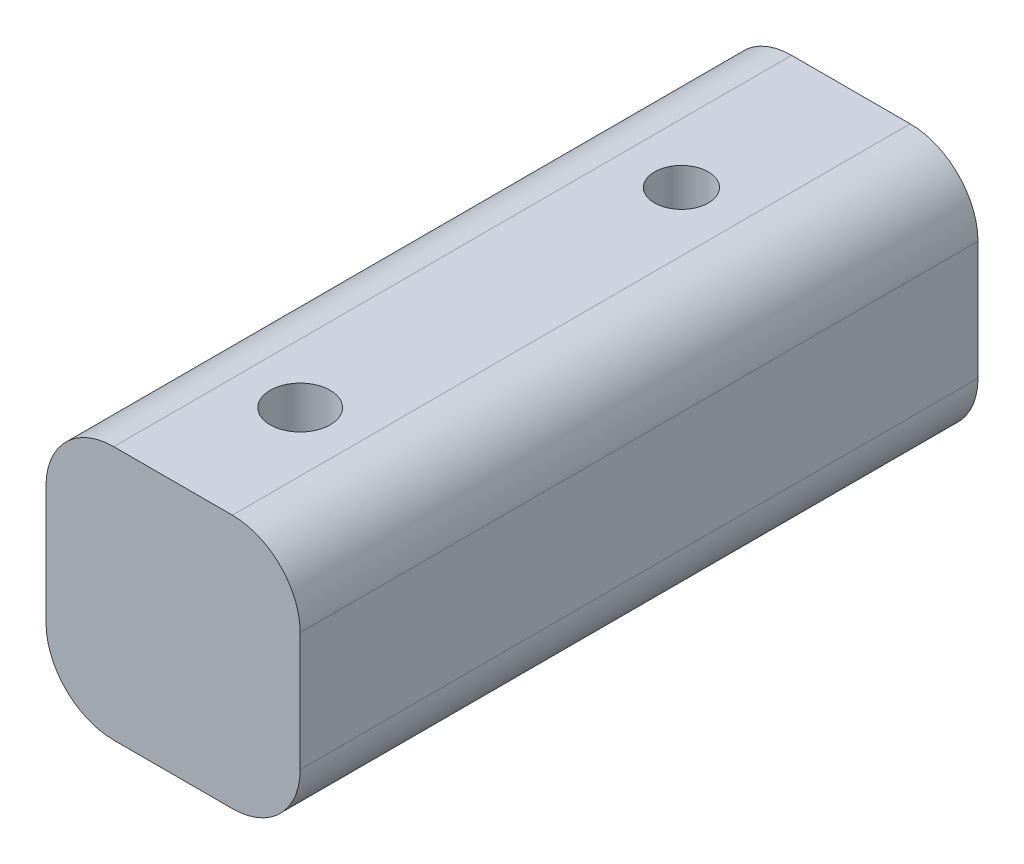
ISO-10303-21;
HEADER;
FILE_DESCRIPTION(('STEP AP214'),'2;1');
FILE_NAME('part.step','',(''),(''),'','','');
FILE_SCHEMA(('AUTOMOTIVE_DESIGN { 1 0 10303 214 1 1 1 1 }'));
ENDSEC;
DATA;
#1=APPLICATION_CONTEXT('core data for automotive mechanical design processes');
#2=APPLICATION_PROTOCOL_DEFINITION('international standard','automotive_design',2000,#1);
#3=PRODUCT_CONTEXT('',#1,'mechanical');
#4=PRODUCT('Part','Part','',(#3));
#5=PRODUCT_RELATED_PRODUCT_CATEGORY('part','',(#4));
#6=PRODUCT_DEFINITION_FORMATION('','',#4);
#7=PRODUCT_DEFINITION_CONTEXT('part definition',#1,'design');
#8=PRODUCT_DEFINITION('design','',#6,#7);
#9=PRODUCT_DEFINITION_SHAPE('','',#8);
#10=(LENGTH_UNIT() NAMED_UNIT(*) SI_UNIT(.MILLI.,.METRE.));
#11=(NAMED_UNIT(*) PLANE_ANGLE_UNIT() SI_UNIT($,.RADIAN.));
#12=(NAMED_UNIT(*) SI_UNIT($,.STERADIAN.) SOLID_ANGLE_UNIT());
#13=UNCERTAINTY_MEASURE_WITH_UNIT(LENGTH_MEASURE(1.E-05),#10,'distance_accuracy_value','');
#14=(GEOMETRIC_REPRESENTATION_CONTEXT(3) GLOBAL_UNCERTAINTY_ASSIGNED_CONTEXT((#13)) GLOBAL_UNIT_ASSIGNED_CONTEXT((#10,
#11,#12)) REPRESENTATION_CONTEXT('',''));
#15=CARTESIAN_POINT('',(0.,0.,0.));
#16=DIRECTION('',(0.,0.,1.));
#17=DIRECTION('',(1.,0.,0.));
#18=AXIS2_PLACEMENT_3D('',#15,#16,#17);
#19=CARTESIAN_POINT('',(9.525,9.525,50.8));
#20=DIRECTION('',(-1.,0.,0.));
#21=DIRECTION('',(0.,-1.,0.));
#22=AXIS2_PLACEMENT_3D('',#19,#20,#21);
#23=PLANE('',#22);
#24=DIRECTION('',(0.,1.,0.));
#25=VECTOR('',#24,1.);
#26=CARTESIAN_POINT('',(9.525,9.525,50.8));
#27=LINE('',#26,#25);
#28=CARTESIAN_POINT('',(9.525,-4.445,50.8));
#29=VERTEX_POINT('',#28);
#30=CARTESIAN_POINT('',(9.525,4.445,50.8));
#31=VERTEX_POINT('',#30);
#32=EDGE_CURVE('E237',#29,#31,#27,.T.);
#33=ORIENTED_EDGE('',*,*,#32,.F.);
#34=DIRECTION('',(0.,0.,-1.));
#35=VECTOR('',#34,1.);
#36=CARTESIAN_POINT('',(9.525,-4.445,50.8));
#37=LINE('',#36,#35);
#38=CARTESIAN_POINT('',(9.525,-4.445,0.));
#39=VERTEX_POINT('',#38);
#40=EDGE_CURVE('E339',#29,#39,#37,.T.);
#41=ORIENTED_EDGE('',*,*,#40,.T.);
#42=DIRECTION('',(0.,1.,0.));
#43=VECTOR('',#42,1.);
#44=CARTESIAN_POINT('',(9.525,9.525,0.));
#45=LINE('',#44,#43);
#46=CARTESIAN_POINT('',(9.525,4.445,0.));
#47=VERTEX_POINT('',#46);
#48=EDGE_CURVE('E220',#39,#47,#45,.T.);
#49=ORIENTED_EDGE('',*,*,#48,.T.);
#50=DIRECTION('',(0.,0.,-1.));
#51=VECTOR('',#50,1.);
#52=CARTESIAN_POINT('',(9.525,4.445,50.8));
#53=LINE('',#52,#51);
#54=EDGE_CURVE('E337',#47,#31,#53,.F.);
#55=ORIENTED_EDGE('',*,*,#54,.T.);
#56=EDGE_LOOP('',(#33,#41,#49,#55));
#57=FACE_BOUND('',#56,.T.);
#58=ADVANCED_FACE('F36',(#57),#23,.F.);
#59=CARTESIAN_POINT('',(-9.525,9.525,50.8));
#60=DIRECTION('',(0.,-1.,0.));
#61=DIRECTION('',(0.,0.,-1.));
#62=AXIS2_PLACEMENT_3D('',#59,#60,#61);
#63=PLANE('',#62);
#64=CARTESIAN_POINT('',(0.,9.525,12.7));
#65=DIRECTION('',(0.,1.,0.));
#66=DIRECTION('',(0.,0.,1.));
#67=AXIS2_PLACEMENT_3D('',#64,#65,#66);
#68=CIRCLE('',#67,2.01929999999999);
#69=CARTESIAN_POINT('',(0.,9.525,14.7193));
#70=VERTEX_POINT('',#69);
#71=EDGE_CURVE('E684',#70,#70,#68,.T.);
#72=ORIENTED_EDGE('',*,*,#71,.F.);
#73=EDGE_LOOP('',(#72));
#74=FACE_BOUND('',#73,.T.);
#75=CARTESIAN_POINT('',(0.,9.525,41.275));
#76=DIRECTION('',(0.,-1.,0.));
#77=DIRECTION('',(0.,0.,-1.));
#78=AXIS2_PLACEMENT_3D('',#75,#76,#77);
#79=CIRCLE('',#78,2.2479);
#80=CARTESIAN_POINT('',(0.,9.525,39.0271));
#81=VERTEX_POINT('',#80);
#82=EDGE_CURVE('E199',#81,#81,#79,.T.);
#83=ORIENTED_EDGE('',*,*,#82,.T.);
#84=EDGE_LOOP('',(#83));
#85=FACE_BOUND('',#84,.T.);
#86=DIRECTION('',(-1.,0.,0.));
#87=VECTOR('',#86,1.);
#88=CARTESIAN_POINT('',(-9.525,9.525,50.8));
#89=LINE('',#88,#87);
#90=CARTESIAN_POINT('',(4.445,9.525,50.8));
#91=VERTEX_POINT('',#90);
#92=CARTESIAN_POINT('',(-4.445,9.525,50.8));
#93=VERTEX_POINT('',#92);
#94=EDGE_CURVE('E239',#91,#93,#89,.T.);
#95=ORIENTED_EDGE('',*,*,#94,.F.);
#96=DIRECTION('',(0.,0.,-1.));
#97=VECTOR('',#96,1.);
#98=CARTESIAN_POINT('',(4.445,9.525,50.8));
#99=LINE('',#98,#97);
#100=CARTESIAN_POINT('',(4.445,9.525,0.));
#101=VERTEX_POINT('',#100);
#102=EDGE_CURVE('E11',#91,#101,#99,.T.);
#103=ORIENTED_EDGE('',*,*,#102,.T.);
#104=DIRECTION('',(-1.,0.,0.));
#105=VECTOR('',#104,1.);
#106=CARTESIAN_POINT('',(-9.525,9.525,0.));
#107=LINE('',#106,#105);
#108=CARTESIAN_POINT('',(-4.445,9.525,0.));
#109=VERTEX_POINT('',#108);
#110=EDGE_CURVE('E250',#101,#109,#107,.T.);
#111=ORIENTED_EDGE('',*,*,#110,.T.);
#112=DIRECTION('',(0.,0.,-1.));
#113=VECTOR('',#112,1.);
#114=CARTESIAN_POINT('',(-4.445,9.525,50.8));
#115=LINE('',#114,#113);
#116=EDGE_CURVE('E44',#109,#93,#115,.F.);
#117=ORIENTED_EDGE('',*,*,#116,.T.);
#118=EDGE_LOOP('',(#95,#103,#111,#117));
#119=FACE_BOUND('',#118,.T.);
#120=ADVANCED_FACE('F355',(#74,#85,#119),#63,.F.);
#121=CARTESIAN_POINT('',(-9.525,9.525,50.8));
#122=DIRECTION('',(1.,0.,0.));
#123=DIRECTION('',(0.,1.,0.));
#124=AXIS2_PLACEMENT_3D('',#121,#122,#123);
#125=PLANE('',#124);
#126=DIRECTION('',(0.,-1.,0.));
#127=VECTOR('',#126,1.);
#128=CARTESIAN_POINT('',(-9.525,9.525,0.));
#129=LINE('',#128,#127);
#130=CARTESIAN_POINT('',(-9.525,4.445,0.));
#131=VERTEX_POINT('',#130);
#132=CARTESIAN_POINT('',(-9.525,-4.445,0.));
#133=VERTEX_POINT('',#132);
#134=EDGE_CURVE('E252',#131,#133,#129,.T.);
#135=ORIENTED_EDGE('',*,*,#134,.T.);
#136=DIRECTION('',(0.,0.,-1.));
#137=VECTOR('',#136,1.);
#138=CARTESIAN_POINT('',(-9.525,-4.445,50.8));
#139=LINE('',#138,#137);
#140=CARTESIAN_POINT('',(-9.525,-4.445,50.8));
#141=VERTEX_POINT('',#140);
#142=EDGE_CURVE('E328',#133,#141,#139,.F.);
#143=ORIENTED_EDGE('',*,*,#142,.T.);
#144=DIRECTION('',(0.,-1.,0.));
#145=VECTOR('',#144,1.);
#146=CARTESIAN_POINT('',(-9.525,9.525,50.8));
#147=LINE('',#146,#145);
#148=CARTESIAN_POINT('',(-9.525,4.445,50.8));
#149=VERTEX_POINT('',#148);
#150=EDGE_CURVE('E242',#149,#141,#147,.T.);
#151=ORIENTED_EDGE('',*,*,#150,.F.);
#152=DIRECTION('',(0.,0.,-1.));
#153=VECTOR('',#152,1.);
#154=CARTESIAN_POINT('',(-9.525,4.445,50.8));
#155=LINE('',#154,#153);
#156=EDGE_CURVE('E325',#149,#131,#155,.T.);
#157=ORIENTED_EDGE('',*,*,#156,.T.);
#158=EDGE_LOOP('',(#135,#143,#151,#157));
#159=FACE_BOUND('',#158,.T.);
#160=ADVANCED_FACE('F363',(#159),#125,.F.);
#161=CARTESIAN_POINT('',(-9.525,-9.525,50.8));
#162=DIRECTION('',(0.,1.,0.));
#163=DIRECTION('',(0.,0.,1.));
#164=AXIS2_PLACEMENT_3D('',#161,#162,#163);
#165=PLANE('',#164);
#166=CARTESIAN_POINT('',(0.,-9.525,12.7));
#167=DIRECTION('',(0.,1.,0.));
#168=DIRECTION('',(0.,0.,1.));
#169=AXIS2_PLACEMENT_3D('',#166,#167,#168);
#170=CIRCLE('',#169,2.01929999999999);
#171=CARTESIAN_POINT('',(0.,-9.525,14.7193));
#172=VERTEX_POINT('',#171);
#173=EDGE_CURVE('E293',#172,#172,#170,.T.);
#174=ORIENTED_EDGE('',*,*,#173,.T.);
#175=EDGE_LOOP('',(#174));
#176=FACE_BOUND('',#175,.T.);
#177=DIRECTION('',(0.,0.,-1.));
#178=VECTOR('',#177,1.);
#179=CARTESIAN_POINT('',(-4.34975,-9.525,50.8));
#180=LINE('',#179,#178);
#181=CARTESIAN_POINT('',(-4.34975,-9.525,38.1));
#182=VERTEX_POINT('',#181);
#183=CARTESIAN_POINT('',(-4.34975,-9.525,44.45));
#184=VERTEX_POINT('',#183);
#185=EDGE_CURVE('E258',#182,#184,#180,.F.);
#186=ORIENTED_EDGE('',*,*,#185,.T.);
#187=CARTESIAN_POINT('',(-0.79375,-9.525,44.45));
#188=DIRECTION('',(0.,1.,0.));
#189=DIRECTION('',(0.,0.,1.));
#190=AXIS2_PLACEMENT_3D('',#187,#188,#189);
#191=CIRCLE('',#190,3.556);
#192=CARTESIAN_POINT('',(-0.79375,-9.525,48.006));
#193=VERTEX_POINT('',#192);
#194=EDGE_CURVE('E272',#184,#193,#191,.T.);
#195=ORIENTED_EDGE('',*,*,#194,.T.);
#196=DIRECTION('',(1.,0.,0.));
#197=VECTOR('',#196,1.);
#198=CARTESIAN_POINT('',(0.793750000000001,-9.525,48.006));
#199=LINE('',#198,#197);
#200=CARTESIAN_POINT('',(0.793750000000001,-9.525,48.006));
#201=VERTEX_POINT('',#200);
#202=EDGE_CURVE('E270',#193,#201,#199,.T.);
#203=ORIENTED_EDGE('',*,*,#202,.T.);
#204=CARTESIAN_POINT('',(0.79375,-9.525,44.45));
#205=DIRECTION('',(0.,1.,0.));
#206=DIRECTION('',(0.,0.,1.));
#207=AXIS2_PLACEMENT_3D('',#204,#205,#206);
#208=CIRCLE('',#207,3.556);
#209=CARTESIAN_POINT('',(4.34975,-9.525,44.45));
#210=VERTEX_POINT('',#209);
#211=EDGE_CURVE('E268',#201,#210,#208,.T.);
#212=ORIENTED_EDGE('',*,*,#211,.T.);
#213=DIRECTION('',(0.,0.,-1.));
#214=VECTOR('',#213,1.);
#215=CARTESIAN_POINT('',(4.34975,-9.525,38.1));
#216=LINE('',#215,#214);
#217=CARTESIAN_POINT('',(4.34975,-9.525,38.1));
#218=VERTEX_POINT('',#217);
#219=EDGE_CURVE('E266',#210,#218,#216,.T.);
#220=ORIENTED_EDGE('',*,*,#219,.T.);
#221=CARTESIAN_POINT('',(0.79375,-9.525,38.1));
#222=DIRECTION('',(0.,1.,0.));
#223=DIRECTION('',(0.,0.,1.));
#224=AXIS2_PLACEMENT_3D('',#221,#222,#223);
#225=CIRCLE('',#224,3.556);
#226=CARTESIAN_POINT('',(0.79375,-9.525,34.544));
#227=VERTEX_POINT('',#226);
#228=EDGE_CURVE('E264',#218,#227,#225,.T.);
#229=ORIENTED_EDGE('',*,*,#228,.T.);
#230=DIRECTION('',(1.,0.,0.));
#231=VECTOR('',#230,1.);
#232=CARTESIAN_POINT('',(-9.525,-9.525,34.544));
#233=LINE('',#232,#231);
#234=CARTESIAN_POINT('',(-0.79375,-9.525,34.544));
#235=VERTEX_POINT('',#234);
#236=EDGE_CURVE('E262',#227,#235,#233,.F.);
#237=ORIENTED_EDGE('',*,*,#236,.T.);
#238=CARTESIAN_POINT('',(-0.79375,-9.525,38.1));
#239=DIRECTION('',(0.,1.,0.));
#240=DIRECTION('',(0.,0.,1.));
#241=AXIS2_PLACEMENT_3D('',#238,#239,#240);
#242=CIRCLE('',#241,3.556);
#243=EDGE_CURVE('E260',#235,#182,#242,.T.);
#244=ORIENTED_EDGE('',*,*,#243,.T.);
#245=EDGE_LOOP('',(#186,#195,#203,#212,#220,#229,#237,#244));
#246=FACE_BOUND('',#245,.T.);
#247=DIRECTION('',(1.,0.,0.));
#248=VECTOR('',#247,1.);
#249=CARTESIAN_POINT('',(-9.525,-9.525,50.8));
#250=LINE('',#249,#248);
#251=CARTESIAN_POINT('',(-4.445,-9.525,50.8));
#252=VERTEX_POINT('',#251);
#253=CARTESIAN_POINT('',(4.445,-9.525,50.8));
#254=VERTEX_POINT('',#253);
#255=EDGE_CURVE('E245',#252,#254,#250,.T.);
#256=ORIENTED_EDGE('',*,*,#255,.F.);
#257=DIRECTION('',(0.,0.,-1.));
#258=VECTOR('',#257,1.);
#259=CARTESIAN_POINT('',(-4.445,-9.525,50.8));
#260=LINE('',#259,#258);
#261=CARTESIAN_POINT('',(-4.445,-9.525,0.));
#262=VERTEX_POINT('',#261);
#263=EDGE_CURVE('E314',#252,#262,#260,.T.);
#264=ORIENTED_EDGE('',*,*,#263,.T.);
#265=DIRECTION('',(1.,0.,0.));
#266=VECTOR('',#265,1.);
#267=CARTESIAN_POINT('',(-9.525,-9.525,0.));
#268=LINE('',#267,#266);
#269=CARTESIAN_POINT('',(4.445,-9.525,0.));
#270=VERTEX_POINT('',#269);
#271=EDGE_CURVE('E240',#262,#270,#268,.T.);
#272=ORIENTED_EDGE('',*,*,#271,.T.);
#273=DIRECTION('',(0.,0.,-1.));
#274=VECTOR('',#273,1.);
#275=CARTESIAN_POINT('',(4.445,-9.525,50.8));
#276=LINE('',#275,#274);
#277=EDGE_CURVE('E289',#270,#254,#276,.F.);
#278=ORIENTED_EDGE('',*,*,#277,.T.);
#279=EDGE_LOOP('',(#256,#264,#272,#278));
#280=FACE_BOUND('',#279,.T.);
#281=ADVANCED_FACE('F371',(#176,#246,#280),#165,.F.);
#282=CARTESIAN_POINT('',(0.,0.,50.8));
#283=DIRECTION('',(0.,0.,1.));
#284=DIRECTION('',(1.,0.,0.));
#285=AXIS2_PLACEMENT_3D('',#282,#283,#284);
#286=PLANE('',#285);
#287=ORIENTED_EDGE('',*,*,#150,.T.);
#288=CARTESIAN_POINT('',(-4.445,-4.445,50.8));
#289=DIRECTION('',(0.,0.,1.));
#290=DIRECTION('',(1.,0.,0.));
#291=AXIS2_PLACEMENT_3D('',#288,#289,#290);
#292=CIRCLE('',#291,5.08);
#293=EDGE_CURVE('E335',#141,#252,#292,.T.);
#294=ORIENTED_EDGE('',*,*,#293,.T.);
#295=ORIENTED_EDGE('',*,*,#255,.T.);
#296=CARTESIAN_POINT('',(4.445,-4.445,50.8));
#297=DIRECTION('',(0.,0.,1.));
#298=DIRECTION('',(1.,0.,0.));
#299=AXIS2_PLACEMENT_3D('',#296,#297,#298);
#300=CIRCLE('',#299,5.08);
#301=EDGE_CURVE('E333',#254,#29,#300,.T.);
#302=ORIENTED_EDGE('',*,*,#301,.T.);
#303=ORIENTED_EDGE('',*,*,#32,.T.);
#304=CARTESIAN_POINT('',(4.445,4.445,50.8));
#305=DIRECTION('',(0.,0.,1.));
#306=DIRECTION('',(1.,0.,0.));
#307=AXIS2_PLACEMENT_3D('',#304,#305,#306);
#308=CIRCLE('',#307,5.08);
#309=EDGE_CURVE('E57',#31,#91,#308,.T.);
#310=ORIENTED_EDGE('',*,*,#309,.T.);
#311=ORIENTED_EDGE('',*,*,#94,.T.);
#312=CARTESIAN_POINT('',(-4.445,4.445,50.8));
#313=DIRECTION('',(0.,0.,1.));
#314=DIRECTION('',(1.,0.,0.));
#315=AXIS2_PLACEMENT_3D('',#312,#313,#314);
#316=CIRCLE('',#315,5.08);
#317=EDGE_CURVE('E330',#93,#149,#316,.T.);
#318=ORIENTED_EDGE('',*,*,#317,.T.);
#319=EDGE_LOOP('',(#287,#294,#295,#302,#303,#310,#311,#318));
#320=FACE_BOUND('',#319,.T.);
#321=ADVANCED_FACE('F357',(#320),#286,.T.);
#322=CARTESIAN_POINT('',(0.,0.,0.));
#323=DIRECTION('',(0.,0.,1.));
#324=DIRECTION('',(1.,0.,0.));
#325=AXIS2_PLACEMENT_3D('',#322,#323,#324);
#326=PLANE('',#325);
#327=ORIENTED_EDGE('',*,*,#271,.F.);
#328=CARTESIAN_POINT('',(-4.445,-4.445,0.));
#329=DIRECTION('',(0.,0.,1.));
#330=DIRECTION('',(1.,0.,0.));
#331=AXIS2_PLACEMENT_3D('',#328,#329,#330);
#332=CIRCLE('',#331,5.08);
#333=EDGE_CURVE('E323',#262,#133,#332,.F.);
#334=ORIENTED_EDGE('',*,*,#333,.T.);
#335=ORIENTED_EDGE('',*,*,#134,.F.);
#336=CARTESIAN_POINT('',(-4.445,4.445,0.));
#337=DIRECTION('',(0.,0.,1.));
#338=DIRECTION('',(1.,0.,0.));
#339=AXIS2_PLACEMENT_3D('',#336,#337,#338);
#340=CIRCLE('',#339,5.08);
#341=EDGE_CURVE('E317',#131,#109,#340,.F.);
#342=ORIENTED_EDGE('',*,*,#341,.T.);
#343=ORIENTED_EDGE('',*,*,#110,.F.);
#344=CARTESIAN_POINT('',(4.445,4.445,0.));
#345=DIRECTION('',(0.,0.,1.));
#346=DIRECTION('',(1.,0.,0.));
#347=AXIS2_PLACEMENT_3D('',#344,#345,#346);
#348=CIRCLE('',#347,5.08);
#349=EDGE_CURVE('E319',#101,#47,#348,.F.);
#350=ORIENTED_EDGE('',*,*,#349,.T.);
#351=ORIENTED_EDGE('',*,*,#48,.F.);
#352=CARTESIAN_POINT('',(4.445,-4.445,0.));
#353=DIRECTION('',(0.,0.,1.));
#354=DIRECTION('',(1.,0.,0.));
#355=AXIS2_PLACEMENT_3D('',#352,#353,#354);
#356=CIRCLE('',#355,5.08);
#357=EDGE_CURVE('E321',#39,#270,#356,.F.);
#358=ORIENTED_EDGE('',*,*,#357,.T.);
#359=EDGE_LOOP('',(#327,#334,#335,#342,#343,#350,#351,#358));
#360=FACE_BOUND('',#359,.T.);
#361=ADVANCED_FACE('F350',(#360),#326,.F.);
#362=CARTESIAN_POINT('',(-0.79375,3.175,44.45));
#363=DIRECTION('',(0.,-1.,0.));
#364=DIRECTION('',(0.,0.,-1.));
#365=AXIS2_PLACEMENT_3D('',#362,#363,#364);
#366=CYLINDRICAL_SURFACE('',#365,3.175);
#367=DIRECTION('',(0.,-1.,0.));
#368=VECTOR('',#367,1.);
#369=CARTESIAN_POINT('',(-0.79375,3.175,47.625));
#370=LINE('',#369,#368);
#371=CARTESIAN_POINT('',(-0.79375,3.175,47.625));
#372=VERTEX_POINT('',#371);
#373=CARTESIAN_POINT('',(-0.79375,-9.144,47.625));
#374=VERTEX_POINT('',#373);
#375=EDGE_CURVE('E218',#372,#374,#370,.T.);
#376=ORIENTED_EDGE('',*,*,#375,.T.);
#377=CARTESIAN_POINT('',(-0.79375,-9.144,44.45));
#378=DIRECTION('',(0.,1.,0.));
#379=DIRECTION('',(0.,0.,1.));
#380=AXIS2_PLACEMENT_3D('',#377,#378,#379);
#381=CIRCLE('',#380,3.175);
#382=CARTESIAN_POINT('',(-3.96875,-9.144,44.45));
#383=VERTEX_POINT('',#382);
#384=EDGE_CURVE('E182',#374,#383,#381,.F.);
#385=ORIENTED_EDGE('',*,*,#384,.T.);
#386=DIRECTION('',(0.,-1.,0.));
#387=VECTOR('',#386,1.);
#388=CARTESIAN_POINT('',(-3.96875,3.175,44.45));
#389=LINE('',#388,#387);
#390=CARTESIAN_POINT('',(-3.96875,3.175,44.45));
#391=VERTEX_POINT('',#390);
#392=EDGE_CURVE('E175',#391,#383,#389,.T.);
#393=ORIENTED_EDGE('',*,*,#392,.F.);
#394=CARTESIAN_POINT('',(-0.79375,3.175,44.45));
#395=DIRECTION('',(0.,-1.,0.));
#396=DIRECTION('',(0.,0.,-1.));
#397=AXIS2_PLACEMENT_3D('',#394,#395,#396);
#398=CIRCLE('',#397,3.175);
#399=EDGE_CURVE('E180',#372,#391,#398,.T.);
#400=ORIENTED_EDGE('',*,*,#399,.F.);
#401=EDGE_LOOP('',(#376,#385,#393,#400));
#402=FACE_BOUND('',#401,.T.);
#403=ADVANCED_FACE('F178',(#402),#366,.F.);
#404=CARTESIAN_POINT('',(-0.79375,3.175,47.625));
#405=DIRECTION('',(0.,0.,-1.));
#406=DIRECTION('',(-1.,0.,0.));
#407=AXIS2_PLACEMENT_3D('',#404,#405,#406);
#408=PLANE('',#407);
#409=DIRECTION('',(0.,-1.,0.));
#410=VECTOR('',#409,1.);
#411=CARTESIAN_POINT('',(0.793750000000001,3.175,47.625));
#412=LINE('',#411,#410);
#413=CARTESIAN_POINT('',(0.793750000000001,3.175,47.625));
#414=VERTEX_POINT('',#413);
#415=CARTESIAN_POINT('',(0.793750000000001,-9.144,47.625));
#416=VERTEX_POINT('',#415);
#417=EDGE_CURVE('E221',#414,#416,#412,.T.);
#418=ORIENTED_EDGE('',*,*,#417,.T.);
#419=DIRECTION('',(1.,0.,0.));
#420=VECTOR('',#419,1.);
#421=CARTESIAN_POINT('',(-0.793749999999999,-9.144,47.625));
#422=LINE('',#421,#420);
#423=EDGE_CURVE('E275',#416,#374,#422,.F.);
#424=ORIENTED_EDGE('',*,*,#423,.T.);
#425=ORIENTED_EDGE('',*,*,#375,.F.);
#426=DIRECTION('',(1.,0.,0.));
#427=VECTOR('',#426,1.);
#428=CARTESIAN_POINT('',(-0.79375,3.175,47.625));
#429=LINE('',#428,#427);
#430=EDGE_CURVE('E185',#372,#414,#429,.T.);
#431=ORIENTED_EDGE('',*,*,#430,.T.);
#432=EDGE_LOOP('',(#418,#424,#425,#431));
#433=FACE_BOUND('',#432,.T.);
#434=ADVANCED_FACE('F450',(#433),#408,.T.);
#435=CARTESIAN_POINT('',(0.79375,3.175,44.45));
#436=DIRECTION('',(0.,-1.,0.));
#437=DIRECTION('',(0.,0.,-1.));
#438=AXIS2_PLACEMENT_3D('',#435,#436,#437);
#439=CYLINDRICAL_SURFACE('',#438,3.175);
#440=DIRECTION('',(0.,-1.,0.));
#441=VECTOR('',#440,1.);
#442=CARTESIAN_POINT('',(3.96875,3.175,44.45));
#443=LINE('',#442,#441);
#444=CARTESIAN_POINT('',(3.96875,3.175,44.45));
#445=VERTEX_POINT('',#444);
#446=CARTESIAN_POINT('',(3.96875,-9.144,44.45));
#447=VERTEX_POINT('',#446);
#448=EDGE_CURVE('E224',#445,#447,#443,.T.);
#449=ORIENTED_EDGE('',*,*,#448,.T.);
#450=CARTESIAN_POINT('',(0.79375,-9.144,44.45));
#451=DIRECTION('',(0.,1.,0.));
#452=DIRECTION('',(0.,0.,1.));
#453=AXIS2_PLACEMENT_3D('',#450,#451,#452);
#454=CIRCLE('',#453,3.175);
#455=EDGE_CURVE('E277',#447,#416,#454,.F.);
#456=ORIENTED_EDGE('',*,*,#455,.T.);
#457=ORIENTED_EDGE('',*,*,#417,.F.);
#458=CARTESIAN_POINT('',(0.79375,3.175,44.45));
#459=DIRECTION('',(0.,-1.,0.));
#460=DIRECTION('',(0.,0.,-1.));
#461=AXIS2_PLACEMENT_3D('',#458,#459,#460);
#462=CIRCLE('',#461,3.175);
#463=EDGE_CURVE('E215',#445,#414,#462,.T.);
#464=ORIENTED_EDGE('',*,*,#463,.F.);
#465=EDGE_LOOP('',(#449,#456,#457,#464));
#466=FACE_BOUND('',#465,.T.);
#467=ADVANCED_FACE('F447',(#466),#439,.F.);
#468=CARTESIAN_POINT('',(3.96875,3.175,44.45));
#469=DIRECTION('',(-1.,0.,0.));
#470=DIRECTION('',(0.,0.,1.));
#471=AXIS2_PLACEMENT_3D('',#468,#469,#470);
#472=PLANE('',#471);
#473=DIRECTION('',(0.,-1.,0.));
#474=VECTOR('',#473,1.);
#475=CARTESIAN_POINT('',(3.96875,3.175,38.1));
#476=LINE('',#475,#474);
#477=CARTESIAN_POINT('',(3.96875,3.175,38.1));
#478=VERTEX_POINT('',#477);
#479=CARTESIAN_POINT('',(3.96875,-9.144,38.1));
#480=VERTEX_POINT('',#479);
#481=EDGE_CURVE('E227',#478,#480,#476,.T.);
#482=ORIENTED_EDGE('',*,*,#481,.T.);
#483=DIRECTION('',(0.,0.,-1.));
#484=VECTOR('',#483,1.);
#485=CARTESIAN_POINT('',(3.96875,-9.144,44.45));
#486=LINE('',#485,#484);
#487=EDGE_CURVE('E279',#480,#447,#486,.F.);
#488=ORIENTED_EDGE('',*,*,#487,.T.);
#489=ORIENTED_EDGE('',*,*,#448,.F.);
#490=DIRECTION('',(0.,0.,-1.));
#491=VECTOR('',#490,1.);
#492=CARTESIAN_POINT('',(3.96875,3.175,44.45));
#493=LINE('',#492,#491);
#494=EDGE_CURVE('E213',#445,#478,#493,.T.);
#495=ORIENTED_EDGE('',*,*,#494,.T.);
#496=EDGE_LOOP('',(#482,#488,#489,#495));
#497=FACE_BOUND('',#496,.T.);
#498=ADVANCED_FACE('F469',(#497),#472,.T.);
#499=CARTESIAN_POINT('',(0.79375,3.175,38.1));
#500=DIRECTION('',(0.,-1.,0.));
#501=DIRECTION('',(0.,0.,-1.));
#502=AXIS2_PLACEMENT_3D('',#499,#500,#501);
#503=CYLINDRICAL_SURFACE('',#502,3.175);
#504=DIRECTION('',(0.,-1.,0.));
#505=VECTOR('',#504,1.);
#506=CARTESIAN_POINT('',(0.79375,3.175,34.925));
#507=LINE('',#506,#505);
#508=CARTESIAN_POINT('',(0.79375,3.175,34.925));
#509=VERTEX_POINT('',#508);
#510=CARTESIAN_POINT('',(0.79375,-9.144,34.925));
#511=VERTEX_POINT('',#510);
#512=EDGE_CURVE('E230',#509,#511,#507,.T.);
#513=ORIENTED_EDGE('',*,*,#512,.T.);
#514=CARTESIAN_POINT('',(0.79375,-9.144,38.1));
#515=DIRECTION('',(0.,1.,0.));
#516=DIRECTION('',(0.,0.,1.));
#517=AXIS2_PLACEMENT_3D('',#514,#515,#516);
#518=CIRCLE('',#517,3.175);
#519=EDGE_CURVE('E281',#511,#480,#518,.F.);
#520=ORIENTED_EDGE('',*,*,#519,.T.);
#521=ORIENTED_EDGE('',*,*,#481,.F.);
#522=CARTESIAN_POINT('',(0.79375,3.175,38.1));
#523=DIRECTION('',(0.,-1.,0.));
#524=DIRECTION('',(0.,0.,-1.));
#525=AXIS2_PLACEMENT_3D('',#522,#523,#524);
#526=CIRCLE('',#525,3.175);
#527=EDGE_CURVE('E210',#509,#478,#526,.T.);
#528=ORIENTED_EDGE('',*,*,#527,.F.);
#529=EDGE_LOOP('',(#513,#520,#521,#528));
#530=FACE_BOUND('',#529,.T.);
#531=ADVANCED_FACE('F467',(#530),#503,.F.);
#532=CARTESIAN_POINT('',(-0.79375,3.175,34.925));
#533=DIRECTION('',(0.,0.,-1.));
#534=DIRECTION('',(-1.,0.,0.));
#535=AXIS2_PLACEMENT_3D('',#532,#533,#534);
#536=PLANE('',#535);
#537=DIRECTION('',(0.,-1.,0.));
#538=VECTOR('',#537,1.);
#539=CARTESIAN_POINT('',(-0.79375,3.175,34.925));
#540=LINE('',#539,#538);
#541=CARTESIAN_POINT('',(-0.79375,3.175,34.925));
#542=VERTEX_POINT('',#541);
#543=CARTESIAN_POINT('',(-0.79375,-9.144,34.925));
#544=VERTEX_POINT('',#543);
#545=EDGE_CURVE('E233',#542,#544,#540,.T.);
#546=ORIENTED_EDGE('',*,*,#545,.T.);
#547=DIRECTION('',(1.,0.,0.));
#548=VECTOR('',#547,1.);
#549=CARTESIAN_POINT('',(-0.79375,-9.144,34.925));
#550=LINE('',#549,#548);
#551=EDGE_CURVE('E283',#544,#511,#550,.T.);
#552=ORIENTED_EDGE('',*,*,#551,.T.);
#553=ORIENTED_EDGE('',*,*,#512,.F.);
#554=DIRECTION('',(1.,0.,0.));
#555=VECTOR('',#554,1.);
#556=CARTESIAN_POINT('',(-0.79375,3.175,34.925));
#557=LINE('',#556,#555);
#558=EDGE_CURVE('E207',#542,#509,#557,.T.);
#559=ORIENTED_EDGE('',*,*,#558,.F.);
#560=EDGE_LOOP('',(#546,#552,#553,#559));
#561=FACE_BOUND('',#560,.T.);
#562=ADVANCED_FACE('F464',(#561),#536,.F.);
#563=CARTESIAN_POINT('',(-0.79375,3.175,38.1));
#564=DIRECTION('',(0.,-1.,0.));
#565=DIRECTION('',(0.,0.,-1.));
#566=AXIS2_PLACEMENT_3D('',#563,#564,#565);
#567=CYLINDRICAL_SURFACE('',#566,3.175);
#568=DIRECTION('',(0.,-1.,0.));
#569=VECTOR('',#568,1.);
#570=CARTESIAN_POINT('',(-3.96875,3.175,38.1));
#571=LINE('',#570,#569);
#572=CARTESIAN_POINT('',(-3.96875,3.175,38.1));
#573=VERTEX_POINT('',#572);
#574=CARTESIAN_POINT('',(-3.96875,-9.144,38.1));
#575=VERTEX_POINT('',#574);
#576=EDGE_CURVE('E184',#573,#575,#571,.T.);
#577=ORIENTED_EDGE('',*,*,#576,.T.);
#578=CARTESIAN_POINT('',(-0.79375,-9.144,38.1));
#579=DIRECTION('',(0.,1.,0.));
#580=DIRECTION('',(0.,0.,1.));
#581=AXIS2_PLACEMENT_3D('',#578,#579,#580);
#582=CIRCLE('',#581,3.175);
#583=EDGE_CURVE('E285',#575,#544,#582,.F.);
#584=ORIENTED_EDGE('',*,*,#583,.T.);
#585=ORIENTED_EDGE('',*,*,#545,.F.);
#586=CARTESIAN_POINT('',(-0.79375,3.175,38.1));
#587=DIRECTION('',(0.,-1.,0.));
#588=DIRECTION('',(0.,0.,-1.));
#589=AXIS2_PLACEMENT_3D('',#586,#587,#588);
#590=CIRCLE('',#589,3.175);
#591=EDGE_CURVE('E194',#573,#542,#590,.T.);
#592=ORIENTED_EDGE('',*,*,#591,.F.);
#593=EDGE_LOOP('',(#577,#584,#585,#592));
#594=FACE_BOUND('',#593,.T.);
#595=ADVANCED_FACE('F459',(#594),#567,.F.);
#596=CARTESIAN_POINT('',(-3.96875,3.175,44.45));
#597=DIRECTION('',(-1.,0.,0.));
#598=DIRECTION('',(0.,0.,1.));
#599=AXIS2_PLACEMENT_3D('',#596,#597,#598);
#600=PLANE('',#599);
#601=ORIENTED_EDGE('',*,*,#392,.T.);
#602=DIRECTION('',(0.,0.,-1.));
#603=VECTOR('',#602,1.);
#604=CARTESIAN_POINT('',(-3.96875,-9.144,44.45));
#605=LINE('',#604,#603);
#606=EDGE_CURVE('E287',#383,#575,#605,.T.);
#607=ORIENTED_EDGE('',*,*,#606,.T.);
#608=ORIENTED_EDGE('',*,*,#576,.F.);
#609=DIRECTION('',(0.,0.,-1.));
#610=VECTOR('',#609,1.);
#611=CARTESIAN_POINT('',(-3.96875,3.175,44.45));
#612=LINE('',#611,#610);
#613=EDGE_CURVE('E188',#391,#573,#612,.T.);
#614=ORIENTED_EDGE('',*,*,#613,.F.);
#615=EDGE_LOOP('',(#601,#607,#608,#614));
#616=FACE_BOUND('',#615,.T.);
#617=ADVANCED_FACE('F189',(#616),#600,.F.);
#618=CARTESIAN_POINT('',(-0.79375,3.175,44.45));
#619=DIRECTION('',(0.,-1.,0.));
#620=DIRECTION('',(0.,0.,-1.));
#621=AXIS2_PLACEMENT_3D('',#618,#619,#620);
#622=PLANE('',#621);
#623=CARTESIAN_POINT('',(0.,3.175,41.275));
#624=DIRECTION('',(0.,-1.,0.));
#625=DIRECTION('',(0.,0.,-1.));
#626=AXIS2_PLACEMENT_3D('',#623,#624,#625);
#627=CIRCLE('',#626,2.2479);
#628=CARTESIAN_POINT('',(0.,3.175,39.0271));
#629=VERTEX_POINT('',#628);
#630=EDGE_CURVE('E202',#629,#629,#627,.T.);
#631=ORIENTED_EDGE('',*,*,#630,.F.);
#632=EDGE_LOOP('',(#631));
#633=FACE_BOUND('',#632,.T.);
#634=ORIENTED_EDGE('',*,*,#399,.T.);
#635=ORIENTED_EDGE('',*,*,#613,.T.);
#636=ORIENTED_EDGE('',*,*,#591,.T.);
#637=ORIENTED_EDGE('',*,*,#558,.T.);
#638=ORIENTED_EDGE('',*,*,#527,.T.);
#639=ORIENTED_EDGE('',*,*,#494,.F.);
#640=ORIENTED_EDGE('',*,*,#463,.T.);
#641=ORIENTED_EDGE('',*,*,#430,.F.);
#642=EDGE_LOOP('',(#634,#635,#636,#637,#638,#639,#640,#641));
#643=FACE_BOUND('',#642,.T.);
#644=ADVANCED_FACE('F197',(#633,#643),#622,.T.);
#645=CARTESIAN_POINT('',(0.,3.175,41.275));
#646=DIRECTION('',(0.,-1.,0.));
#647=DIRECTION('',(0.,0.,-1.));
#648=AXIS2_PLACEMENT_3D('',#645,#646,#647);
#649=CYLINDRICAL_SURFACE('',#648,2.2479);
#650=ORIENTED_EDGE('',*,*,#82,.F.);
#651=EDGE_LOOP('',(#650));
#652=FACE_BOUND('',#651,.T.);
#653=ORIENTED_EDGE('',*,*,#630,.T.);
#654=EDGE_LOOP('',(#653));
#655=FACE_BOUND('',#654,.T.);
#656=ADVANCED_FACE('F421',(#652,#655),#649,.F.);
#657=CARTESIAN_POINT('',(0.79375,-9.144,38.1));
#658=DIRECTION('',(0.,1.,0.));
#659=DIRECTION('',(0.,0.,1.));
#660=AXIS2_PLACEMENT_3D('',#657,#658,#659);
#661=TOROIDAL_SURFACE('',#660,3.556,0.381);
#662=CARTESIAN_POINT('',(0.79375,-9.144,34.544));
#663=DIRECTION('',(-1.,0.,0.));
#664=DIRECTION('',(0.,0.,1.));
#665=AXIS2_PLACEMENT_3D('',#662,#663,#664);
#666=CIRCLE('',#665,0.381);
#667=EDGE_CURVE('E307',#227,#511,#666,.T.);
#668=ORIENTED_EDGE('',*,*,#667,.F.);
#669=ORIENTED_EDGE('',*,*,#228,.F.);
#670=CARTESIAN_POINT('',(4.34975,-9.144,38.1));
#671=DIRECTION('',(0.,0.,1.));
#672=DIRECTION('',(1.,0.,0.));
#673=AXIS2_PLACEMENT_3D('',#670,#671,#672);
#674=CIRCLE('',#673,0.381);
#675=EDGE_CURVE('E310',#480,#218,#674,.T.);
#676=ORIENTED_EDGE('',*,*,#675,.F.);
#677=ORIENTED_EDGE('',*,*,#519,.F.);
#678=EDGE_LOOP('',(#668,#669,#676,#677));
#679=FACE_BOUND('',#678,.T.);
#680=ADVANCED_FACE('F418',(#679),#661,.T.);
#681=CARTESIAN_POINT('',(4.34975,-9.144,50.8));
#682=DIRECTION('',(0.,0.,1.));
#683=DIRECTION('',(1.,0.,0.));
#684=AXIS2_PLACEMENT_3D('',#681,#682,#683);
#685=CYLINDRICAL_SURFACE('',#684,0.381);
#686=ORIENTED_EDGE('',*,*,#675,.T.);
#687=ORIENTED_EDGE('',*,*,#219,.F.);
#688=CARTESIAN_POINT('',(4.34975,-9.144,44.45));
#689=DIRECTION('',(0.,0.,1.));
#690=DIRECTION('',(1.,0.,0.));
#691=AXIS2_PLACEMENT_3D('',#688,#689,#690);
#692=CIRCLE('',#691,0.381);
#693=EDGE_CURVE('E304',#447,#210,#692,.T.);
#694=ORIENTED_EDGE('',*,*,#693,.F.);
#695=ORIENTED_EDGE('',*,*,#487,.F.);
#696=EDGE_LOOP('',(#686,#687,#694,#695));
#697=FACE_BOUND('',#696,.T.);
#698=ADVANCED_FACE('F414',(#697),#685,.T.);
#699=CARTESIAN_POINT('',(-0.79375,-9.144,34.544));
#700=DIRECTION('',(1.,0.,0.));
#701=DIRECTION('',(0.,0.,-1.));
#702=AXIS2_PLACEMENT_3D('',#699,#700,#701);
#703=CYLINDRICAL_SURFACE('',#702,0.381);
#704=ORIENTED_EDGE('',*,*,#667,.T.);
#705=ORIENTED_EDGE('',*,*,#551,.F.);
#706=CARTESIAN_POINT('',(-0.79375,-9.144,34.544));
#707=DIRECTION('',(-1.,0.,0.));
#708=DIRECTION('',(0.,0.,1.));
#709=AXIS2_PLACEMENT_3D('',#706,#707,#708);
#710=CIRCLE('',#709,0.381);
#711=EDGE_CURVE('E301',#235,#544,#710,.T.);
#712=ORIENTED_EDGE('',*,*,#711,.F.);
#713=ORIENTED_EDGE('',*,*,#236,.F.);
#714=EDGE_LOOP('',(#704,#705,#712,#713));
#715=FACE_BOUND('',#714,.T.);
#716=ADVANCED_FACE('F410',(#715),#703,.T.);
#717=CARTESIAN_POINT('',(0.79375,-9.144,44.45));
#718=DIRECTION('',(0.,1.,0.));
#719=DIRECTION('',(0.,0.,1.));
#720=AXIS2_PLACEMENT_3D('',#717,#718,#719);
#721=TOROIDAL_SURFACE('',#720,3.556,0.381);
#722=ORIENTED_EDGE('',*,*,#693,.T.);
#723=ORIENTED_EDGE('',*,*,#211,.F.);
#724=CARTESIAN_POINT('',(0.793750000000001,-9.144,48.006));
#725=DIRECTION('',(-1.,0.,0.));
#726=DIRECTION('',(0.,0.,1.));
#727=AXIS2_PLACEMENT_3D('',#724,#725,#726);
#728=CIRCLE('',#727,0.381);
#729=EDGE_CURVE('E298',#416,#201,#728,.T.);
#730=ORIENTED_EDGE('',*,*,#729,.F.);
#731=ORIENTED_EDGE('',*,*,#455,.F.);
#732=EDGE_LOOP('',(#722,#723,#730,#731));
#733=FACE_BOUND('',#732,.T.);
#734=ADVANCED_FACE('F406',(#733),#721,.T.);
#735=CARTESIAN_POINT('',(-0.79375,-9.144,38.1));
#736=DIRECTION('',(0.,1.,0.));
#737=DIRECTION('',(0.,0.,1.));
#738=AXIS2_PLACEMENT_3D('',#735,#736,#737);
#739=TOROIDAL_SURFACE('',#738,3.556,0.381);
#740=ORIENTED_EDGE('',*,*,#711,.T.);
#741=ORIENTED_EDGE('',*,*,#583,.F.);
#742=CARTESIAN_POINT('',(-4.34975,-9.144,38.1));
#743=DIRECTION('',(0.,0.,1.));
#744=DIRECTION('',(1.,0.,0.));
#745=AXIS2_PLACEMENT_3D('',#742,#743,#744);
#746=CIRCLE('',#745,0.381);
#747=EDGE_CURVE('E295',#182,#575,#746,.T.);
#748=ORIENTED_EDGE('',*,*,#747,.F.);
#749=ORIENTED_EDGE('',*,*,#243,.F.);
#750=EDGE_LOOP('',(#740,#741,#748,#749));
#751=FACE_BOUND('',#750,.T.);
#752=ADVANCED_FACE('F402',(#751),#739,.T.);
#753=CARTESIAN_POINT('',(-9.525,-9.144,48.006));
#754=DIRECTION('',(-1.,0.,0.));
#755=DIRECTION('',(0.,0.,1.));
#756=AXIS2_PLACEMENT_3D('',#753,#754,#755);
#757=CYLINDRICAL_SURFACE('',#756,0.381);
#758=ORIENTED_EDGE('',*,*,#729,.T.);
#759=ORIENTED_EDGE('',*,*,#202,.F.);
#760=CARTESIAN_POINT('',(-0.79375,-9.144,48.006));
#761=DIRECTION('',(-1.,0.,0.));
#762=DIRECTION('',(0.,0.,1.));
#763=AXIS2_PLACEMENT_3D('',#760,#761,#762);
#764=CIRCLE('',#763,0.381);
#765=EDGE_CURVE('E292',#374,#193,#764,.T.);
#766=ORIENTED_EDGE('',*,*,#765,.F.);
#767=ORIENTED_EDGE('',*,*,#423,.F.);
#768=EDGE_LOOP('',(#758,#759,#766,#767));
#769=FACE_BOUND('',#768,.T.);
#770=ADVANCED_FACE('F398',(#769),#757,.T.);
#771=CARTESIAN_POINT('',(-4.34975,-9.144,44.45));
#772=DIRECTION('',(0.,0.,-1.));
#773=DIRECTION('',(-1.,0.,0.));
#774=AXIS2_PLACEMENT_3D('',#771,#772,#773);
#775=CYLINDRICAL_SURFACE('',#774,0.381);
#776=ORIENTED_EDGE('',*,*,#747,.T.);
#777=ORIENTED_EDGE('',*,*,#606,.F.);
#778=CARTESIAN_POINT('',(-4.34975,-9.144,44.45));
#779=DIRECTION('',(0.,0.,1.));
#780=DIRECTION('',(1.,0.,0.));
#781=AXIS2_PLACEMENT_3D('',#778,#779,#780);
#782=CIRCLE('',#781,0.381);
#783=EDGE_CURVE('E290',#184,#383,#782,.T.);
#784=ORIENTED_EDGE('',*,*,#783,.F.);
#785=ORIENTED_EDGE('',*,*,#185,.F.);
#786=EDGE_LOOP('',(#776,#777,#784,#785));
#787=FACE_BOUND('',#786,.T.);
#788=ADVANCED_FACE('F394',(#787),#775,.T.);
#789=CARTESIAN_POINT('',(-0.79375,-9.144,44.45));
#790=DIRECTION('',(0.,1.,0.));
#791=DIRECTION('',(0.,0.,1.));
#792=AXIS2_PLACEMENT_3D('',#789,#790,#791);
#793=TOROIDAL_SURFACE('',#792,3.556,0.381);
#794=ORIENTED_EDGE('',*,*,#765,.T.);
#795=ORIENTED_EDGE('',*,*,#194,.F.);
#796=ORIENTED_EDGE('',*,*,#783,.T.);
#797=ORIENTED_EDGE('',*,*,#384,.F.);
#798=EDGE_LOOP('',(#794,#795,#796,#797));
#799=FACE_BOUND('',#798,.T.);
#800=ADVANCED_FACE('F391',(#799),#793,.T.);
#801=CARTESIAN_POINT('',(0.,9.525,12.7));
#802=DIRECTION('',(0.,1.,0.));
#803=DIRECTION('',(0.,0.,1.));
#804=AXIS2_PLACEMENT_3D('',#801,#802,#803);
#805=CYLINDRICAL_SURFACE('',#804,2.01929999999999);
#806=ORIENTED_EDGE('',*,*,#173,.F.);
#807=EDGE_LOOP('',(#806));
#808=FACE_BOUND('',#807,.T.);
#809=ORIENTED_EDGE('',*,*,#71,.T.);
#810=EDGE_LOOP('',(#809));
#811=FACE_BOUND('',#810,.T.);
#812=ADVANCED_FACE('F380',(#808,#811),#805,.F.);
#813=CARTESIAN_POINT('',(-4.445,-4.445,50.8));
#814=DIRECTION('',(0.,0.,-1.));
#815=DIRECTION('',(-1.,0.,0.));
#816=AXIS2_PLACEMENT_3D('',#813,#814,#815);
#817=CYLINDRICAL_SURFACE('',#816,5.08);
#818=ORIENTED_EDGE('',*,*,#293,.F.);
#819=ORIENTED_EDGE('',*,*,#142,.F.);
#820=ORIENTED_EDGE('',*,*,#333,.F.);
#821=ORIENTED_EDGE('',*,*,#263,.F.);
#822=EDGE_LOOP('',(#818,#819,#820,#821));
#823=FACE_BOUND('',#822,.T.);
#824=ADVANCED_FACE('F368',(#823),#817,.T.);
#825=CARTESIAN_POINT('',(4.445,-4.445,50.8));
#826=DIRECTION('',(0.,0.,-1.));
#827=DIRECTION('',(-1.,0.,0.));
#828=AXIS2_PLACEMENT_3D('',#825,#826,#827);
#829=CYLINDRICAL_SURFACE('',#828,5.08);
#830=ORIENTED_EDGE('',*,*,#301,.F.);
#831=ORIENTED_EDGE('',*,*,#277,.F.);
#832=ORIENTED_EDGE('',*,*,#357,.F.);
#833=ORIENTED_EDGE('',*,*,#40,.F.);
#834=EDGE_LOOP('',(#830,#831,#832,#833));
#835=FACE_BOUND('',#834,.T.);
#836=ADVANCED_FACE('F373',(#835),#829,.T.);
#837=CARTESIAN_POINT('',(4.445,4.445,50.8));
#838=DIRECTION('',(0.,0.,-1.));
#839=DIRECTION('',(-1.,0.,0.));
#840=AXIS2_PLACEMENT_3D('',#837,#838,#839);
#841=CYLINDRICAL_SURFACE('',#840,5.08);
#842=ORIENTED_EDGE('',*,*,#309,.F.);
#843=ORIENTED_EDGE('',*,*,#54,.F.);
#844=ORIENTED_EDGE('',*,*,#349,.F.);
#845=ORIENTED_EDGE('',*,*,#102,.F.);
#846=EDGE_LOOP('',(#842,#843,#844,#845));
#847=FACE_BOUND('',#846,.T.);
#848=ADVANCED_FACE('F354',(#847),#841,.T.);
#849=CARTESIAN_POINT('',(-4.445,4.445,50.8));
#850=DIRECTION('',(0.,0.,-1.));
#851=DIRECTION('',(-1.,0.,0.));
#852=AXIS2_PLACEMENT_3D('',#849,#850,#851);
#853=CYLINDRICAL_SURFACE('',#852,5.08);
#854=ORIENTED_EDGE('',*,*,#317,.F.);
#855=ORIENTED_EDGE('',*,*,#116,.F.);
#856=ORIENTED_EDGE('',*,*,#341,.F.);
#857=ORIENTED_EDGE('',*,*,#156,.F.);
#858=EDGE_LOOP('',(#854,#855,#856,#857));
#859=FACE_BOUND('',#858,.T.);
#860=ADVANCED_FACE('F38',(#859),#853,.T.);
#861=CLOSED_SHELL('',(#58,#120,#160,#281,#321,#361,#403,#434,#467,#498,#531,#562,#595,#617,#644,
#656,#680,#698,#716,#734,#752,#770,#788,#800,#812,#824,#836,#848,#860));
#862=MANIFOLD_SOLID_BREP('B2',#861);
#863=ADVANCED_BREP_SHAPE_REPRESENTATION('',(#18,#862),#14);
#864=SHAPE_DEFINITION_REPRESENTATION(#9,#863);
ENDSEC;
END-ISO-10303-21;
